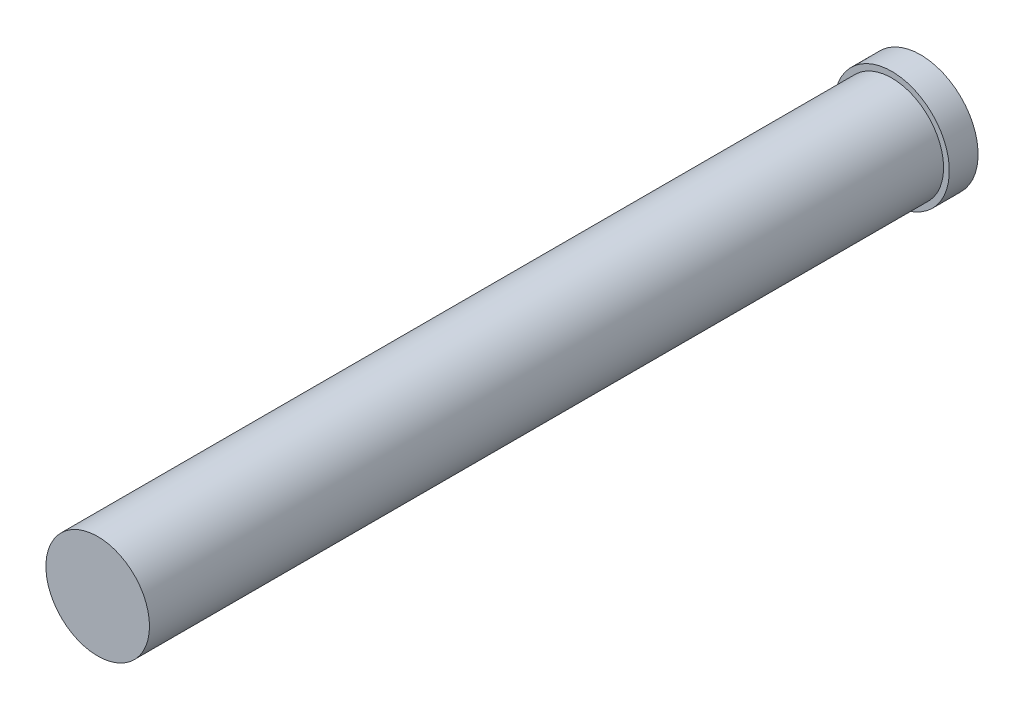
ISO-10303-21;
HEADER;
FILE_DESCRIPTION(('STEP AP214'),'2;1');
FILE_NAME('part.step','',(''),(''),'','','');
FILE_SCHEMA(('AUTOMOTIVE_DESIGN { 1 0 10303 214 1 1 1 1 }'));
ENDSEC;
DATA;
#1=APPLICATION_CONTEXT('core data for automotive mechanical design processes');
#2=APPLICATION_PROTOCOL_DEFINITION('international standard','automotive_design',2000,#1);
#3=PRODUCT_CONTEXT('',#1,'mechanical');
#4=PRODUCT('Part','Part','',(#3));
#5=PRODUCT_RELATED_PRODUCT_CATEGORY('part','',(#4));
#6=PRODUCT_DEFINITION_FORMATION('','',#4);
#7=PRODUCT_DEFINITION_CONTEXT('part definition',#1,'design');
#8=PRODUCT_DEFINITION('design','',#6,#7);
#9=PRODUCT_DEFINITION_SHAPE('','',#8);
#10=(LENGTH_UNIT() NAMED_UNIT(*) SI_UNIT(.MILLI.,.METRE.));
#11=(NAMED_UNIT(*) PLANE_ANGLE_UNIT() SI_UNIT($,.RADIAN.));
#12=(NAMED_UNIT(*) SI_UNIT($,.STERADIAN.) SOLID_ANGLE_UNIT());
#13=UNCERTAINTY_MEASURE_WITH_UNIT(LENGTH_MEASURE(1.E-05),#10,'distance_accuracy_value','');
#14=(GEOMETRIC_REPRESENTATION_CONTEXT(3) GLOBAL_UNCERTAINTY_ASSIGNED_CONTEXT((#13)) GLOBAL_UNIT_ASSIGNED_CONTEXT((#10,
#11,#12)) REPRESENTATION_CONTEXT('',''));
#15=CARTESIAN_POINT('',(0.,0.,0.));
#16=DIRECTION('',(0.,0.,1.));
#17=DIRECTION('',(1.,0.,0.));
#18=AXIS2_PLACEMENT_3D('',#15,#16,#17);
#19=CARTESIAN_POINT('',(0.,0.,-17.526));
#20=DIRECTION('',(0.,0.,1.));
#21=DIRECTION('',(1.,0.,0.));
#22=AXIS2_PLACEMENT_3D('',#19,#20,#21);
#23=CYLINDRICAL_SURFACE('',#22,2.286);
#24=CARTESIAN_POINT('',(0.,0.,-17.526));
#25=DIRECTION('',(0.,0.,1.));
#26=DIRECTION('',(1.,0.,0.));
#27=AXIS2_PLACEMENT_3D('',#24,#25,#26);
#28=CIRCLE('',#27,2.286);
#29=CARTESIAN_POINT('',(2.286,0.,-17.526));
#30=VERTEX_POINT('',#29);
#31=EDGE_CURVE('E43',#30,#30,#28,.T.);
#32=ORIENTED_EDGE('',*,*,#31,.T.);
#33=EDGE_LOOP('',(#32));
#34=FACE_BOUND('',#33,.T.);
#35=CARTESIAN_POINT('',(0.,0.,17.526));
#36=DIRECTION('',(0.,0.,1.));
#37=DIRECTION('',(1.,0.,0.));
#38=AXIS2_PLACEMENT_3D('',#35,#36,#37);
#39=CIRCLE('',#38,2.286);
#40=CARTESIAN_POINT('',(2.286,0.,17.526));
#41=VERTEX_POINT('',#40);
#42=EDGE_CURVE('E10',#41,#41,#39,.T.);
#43=ORIENTED_EDGE('',*,*,#42,.F.);
#44=EDGE_LOOP('',(#43));
#45=FACE_BOUND('',#44,.T.);
#46=ADVANCED_FACE('F37',(#34,#45),#23,.T.);
#47=CARTESIAN_POINT('',(0.,0.,17.526));
#48=DIRECTION('',(0.,0.,1.));
#49=DIRECTION('',(1.,0.,0.));
#50=AXIS2_PLACEMENT_3D('',#47,#48,#49);
#51=PLANE('',#50);
#52=ORIENTED_EDGE('',*,*,#42,.T.);
#53=EDGE_LOOP('',(#52));
#54=FACE_BOUND('',#53,.T.);
#55=ADVANCED_FACE('F71',(#54),#51,.T.);
#56=CARTESIAN_POINT('',(0.,0.,-18.796));
#57=DIRECTION('',(0.,0.,1.));
#58=DIRECTION('',(1.,0.,0.));
#59=AXIS2_PLACEMENT_3D('',#56,#57,#58);
#60=CYLINDRICAL_SURFACE('',#59,2.54);
#61=CARTESIAN_POINT('',(0.,0.,-18.796));
#62=DIRECTION('',(0.,0.,-1.));
#63=DIRECTION('',(-1.,0.,0.));
#64=AXIS2_PLACEMENT_3D('',#61,#62,#63);
#65=CIRCLE('',#64,2.54);
#66=CARTESIAN_POINT('',(-2.54,0.,-18.796));
#67=VERTEX_POINT('',#66);
#68=EDGE_CURVE('E47',#67,#67,#65,.T.);
#69=ORIENTED_EDGE('',*,*,#68,.F.);
#70=EDGE_LOOP('',(#69));
#71=FACE_BOUND('',#70,.T.);
#72=CARTESIAN_POINT('',(0.,0.,-17.526));
#73=DIRECTION('',(0.,0.,-1.));
#74=DIRECTION('',(-1.,0.,0.));
#75=AXIS2_PLACEMENT_3D('',#72,#73,#74);
#76=CIRCLE('',#75,2.54);
#77=CARTESIAN_POINT('',(-2.54,0.,-17.526));
#78=VERTEX_POINT('',#77);
#79=EDGE_CURVE('E51',#78,#78,#76,.T.);
#80=ORIENTED_EDGE('',*,*,#79,.T.);
#81=EDGE_LOOP('',(#80));
#82=FACE_BOUND('',#81,.T.);
#83=ADVANCED_FACE('F57',(#71,#82),#60,.T.);
#84=CARTESIAN_POINT('',(0.,0.,-18.796));
#85=DIRECTION('',(0.,0.,-1.));
#86=DIRECTION('',(-1.,0.,0.));
#87=AXIS2_PLACEMENT_3D('',#84,#85,#86);
#88=PLANE('',#87);
#89=ORIENTED_EDGE('',*,*,#68,.T.);
#90=EDGE_LOOP('',(#89));
#91=FACE_BOUND('',#90,.T.);
#92=ADVANCED_FACE('F61',(#91),#88,.T.);
#93=CARTESIAN_POINT('',(0.,0.,-17.526));
#94=DIRECTION('',(0.,0.,-1.));
#95=DIRECTION('',(-1.,0.,0.));
#96=AXIS2_PLACEMENT_3D('',#93,#94,#95);
#97=PLANE('',#96);
#98=ORIENTED_EDGE('',*,*,#31,.F.);
#99=EDGE_LOOP('',(#98));
#100=FACE_BOUND('',#99,.T.);
#101=ORIENTED_EDGE('',*,*,#79,.F.);
#102=EDGE_LOOP('',(#101));
#103=FACE_BOUND('',#102,.T.);
#104=ADVANCED_FACE('F59',(#100,#103),#97,.F.);
#105=CLOSED_SHELL('',(#46,#55,#83,#92,#104));
#106=MANIFOLD_SOLID_BREP('B2',#105);
#107=ADVANCED_BREP_SHAPE_REPRESENTATION('',(#18,#106),#14);
#108=SHAPE_DEFINITION_REPRESENTATION(#9,#107);
ENDSEC;
END-ISO-10303-21;
